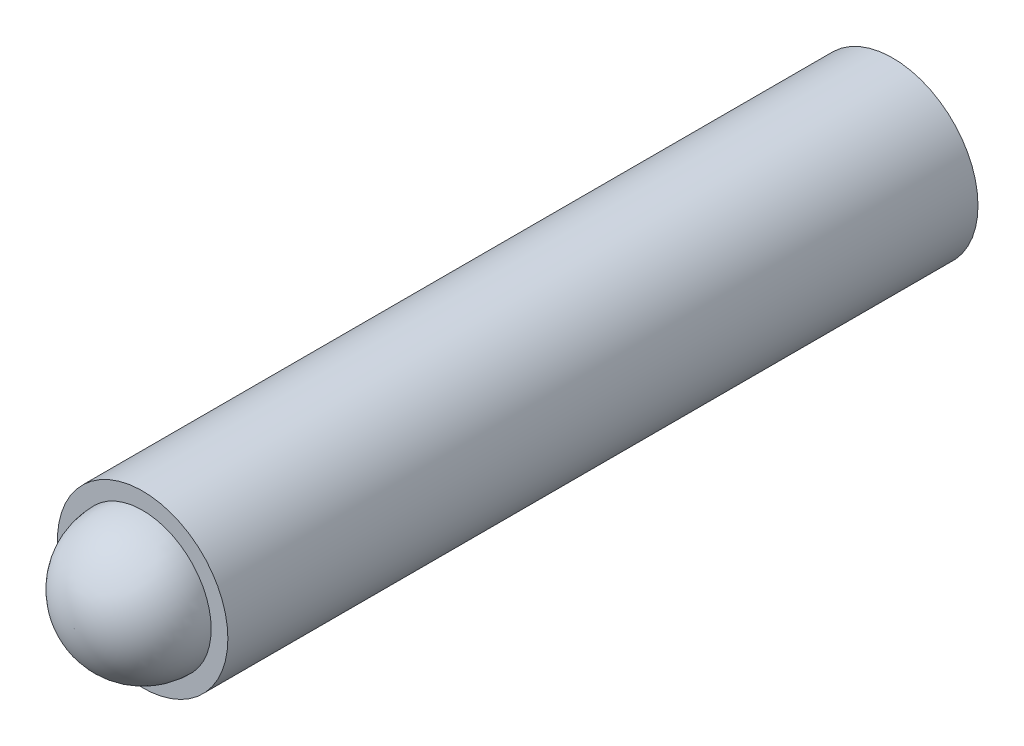
ISO-10303-21;
HEADER;
FILE_DESCRIPTION(('STEP AP214'),'2;1');
FILE_NAME('part.step','',(''),(''),'','','');
FILE_SCHEMA(('AUTOMOTIVE_DESIGN { 1 0 10303 214 1 1 1 1 }'));
ENDSEC;
DATA;
#1=APPLICATION_CONTEXT('core data for automotive mechanical design processes');
#2=APPLICATION_PROTOCOL_DEFINITION('international standard','automotive_design',2000,#1);
#3=PRODUCT_CONTEXT('',#1,'mechanical');
#4=PRODUCT('Part','Part','',(#3));
#5=PRODUCT_RELATED_PRODUCT_CATEGORY('part','',(#4));
#6=PRODUCT_DEFINITION_FORMATION('','',#4);
#7=PRODUCT_DEFINITION_CONTEXT('part definition',#1,'design');
#8=PRODUCT_DEFINITION('design','',#6,#7);
#9=PRODUCT_DEFINITION_SHAPE('','',#8);
#10=(LENGTH_UNIT() NAMED_UNIT(*) SI_UNIT(.MILLI.,.METRE.));
#11=(NAMED_UNIT(*) PLANE_ANGLE_UNIT() SI_UNIT($,.RADIAN.));
#12=(NAMED_UNIT(*) SI_UNIT($,.STERADIAN.) SOLID_ANGLE_UNIT());
#13=UNCERTAINTY_MEASURE_WITH_UNIT(LENGTH_MEASURE(1.E-05),#10,'distance_accuracy_value','');
#14=(GEOMETRIC_REPRESENTATION_CONTEXT(3) GLOBAL_UNCERTAINTY_ASSIGNED_CONTEXT((#13)) GLOBAL_UNIT_ASSIGNED_CONTEXT((#10,
#11,#12)) REPRESENTATION_CONTEXT('',''));
#15=CARTESIAN_POINT('',(0.,0.,0.));
#16=DIRECTION('',(0.,0.,1.));
#17=DIRECTION('',(1.,0.,0.));
#18=AXIS2_PLACEMENT_3D('',#15,#16,#17);
#19=CARTESIAN_POINT('',(0.,0.,24.));
#20=DIRECTION('',(0.,0.,-1.));
#21=DIRECTION('',(-1.,0.,0.));
#22=AXIS2_PLACEMENT_3D('',#19,#20,#21);
#23=CYLINDRICAL_SURFACE('',#22,2.5);
#24=CARTESIAN_POINT('',(0.,0.,22.));
#25=DIRECTION('',(0.,0.,1.));
#26=DIRECTION('',(1.,0.,0.));
#27=AXIS2_PLACEMENT_3D('',#24,#25,#26);
#28=CIRCLE('',#27,2.5);
#29=CARTESIAN_POINT('',(2.5,0.,22.));
#30=VERTEX_POINT('',#29);
#31=EDGE_CURVE('E41',#30,#30,#28,.T.);
#32=ORIENTED_EDGE('',*,*,#31,.F.);
#33=EDGE_LOOP('',(#32));
#34=FACE_BOUND('',#33,.T.);
#35=CARTESIAN_POINT('',(0.,0.,0.));
#36=DIRECTION('',(0.,0.,1.));
#37=DIRECTION('',(1.,0.,0.));
#38=AXIS2_PLACEMENT_3D('',#35,#36,#37);
#39=CIRCLE('',#38,2.5);
#40=CARTESIAN_POINT('',(2.5,0.,0.));
#41=VERTEX_POINT('',#40);
#42=EDGE_CURVE('E10',#41,#41,#39,.T.);
#43=ORIENTED_EDGE('',*,*,#42,.T.);
#44=EDGE_LOOP('',(#43));
#45=FACE_BOUND('',#44,.T.);
#46=ADVANCED_FACE('F31',(#34,#45),#23,.T.);
#47=CARTESIAN_POINT('',(0.,0.,0.));
#48=DIRECTION('',(0.,0.,1.));
#49=DIRECTION('',(1.,0.,0.));
#50=AXIS2_PLACEMENT_3D('',#47,#48,#49);
#51=PLANE('',#50);
#52=ORIENTED_EDGE('',*,*,#42,.F.);
#53=EDGE_LOOP('',(#52));
#54=FACE_BOUND('',#53,.T.);
#55=ADVANCED_FACE('F61',(#54),#51,.F.);
#56=CARTESIAN_POINT('',(0.,0.,22.));
#57=DIRECTION('',(0.,0.,1.));
#58=DIRECTION('',(1.,0.,0.));
#59=AXIS2_PLACEMENT_3D('',#56,#57,#58);
#60=DEGENERATE_TOROIDAL_SURFACE('',#59,0.00999999999999978,2.,.T.);
#61=CARTESIAN_POINT('',(0.,0.,24.));
#62=DIRECTION('',(0.,0.,1.));
#63=DIRECTION('',(1.,0.,0.));
#64=AXIS2_PLACEMENT_3D('',#61,#62,#63);
#65=CIRCLE('',#64,0.01);
#66=CARTESIAN_POINT('',(0.01,0.,24.));
#67=VERTEX_POINT('',#66);
#68=EDGE_CURVE('E37',#67,#67,#65,.T.);
#69=ORIENTED_EDGE('',*,*,#68,.F.);
#70=EDGE_LOOP('',(#69));
#71=FACE_BOUND('',#70,.T.);
#72=CARTESIAN_POINT('',(0.,0.,22.));
#73=DIRECTION('',(0.,0.,1.));
#74=DIRECTION('',(1.,0.,0.));
#75=AXIS2_PLACEMENT_3D('',#72,#73,#74);
#76=CIRCLE('',#75,2.01);
#77=CARTESIAN_POINT('',(2.01,0.,22.));
#78=VERTEX_POINT('',#77);
#79=EDGE_CURVE('E45',#78,#78,#76,.T.);
#80=ORIENTED_EDGE('',*,*,#79,.T.);
#81=EDGE_LOOP('',(#80));
#82=FACE_BOUND('',#81,.T.);
#83=ADVANCED_FACE('F51',(#71,#82),#60,.T.);
#84=CARTESIAN_POINT('',(2.01,0.,22.));
#85=DIRECTION('',(0.,0.,-1.));
#86=DIRECTION('',(-1.,0.,0.));
#87=AXIS2_PLACEMENT_3D('',#84,#85,#86);
#88=PLANE('',#87);
#89=ORIENTED_EDGE('',*,*,#79,.F.);
#90=EDGE_LOOP('',(#89));
#91=FACE_BOUND('',#90,.T.);
#92=ORIENTED_EDGE('',*,*,#31,.T.);
#93=EDGE_LOOP('',(#92));
#94=FACE_BOUND('',#93,.T.);
#95=ADVANCED_FACE('F53',(#91,#94),#88,.F.);
#96=CARTESIAN_POINT('',(0.,0.,24.));
#97=DIRECTION('',(0.,0.,1.));
#98=DIRECTION('',(1.,0.,0.));
#99=AXIS2_PLACEMENT_3D('',#96,#97,#98);
#100=PLANE('',#99);
#101=ORIENTED_EDGE('',*,*,#68,.T.);
#102=EDGE_LOOP('',(#101));
#103=FACE_BOUND('',#102,.T.);
#104=ADVANCED_FACE('F56',(#103),#100,.T.);
#105=CLOSED_SHELL('',(#46,#55,#83,#95,#104));
#106=MANIFOLD_SOLID_BREP('B2',#105);
#107=ADVANCED_BREP_SHAPE_REPRESENTATION('',(#18,#106),#14);
#108=SHAPE_DEFINITION_REPRESENTATION(#9,#107);
ENDSEC;
END-ISO-10303-21;
